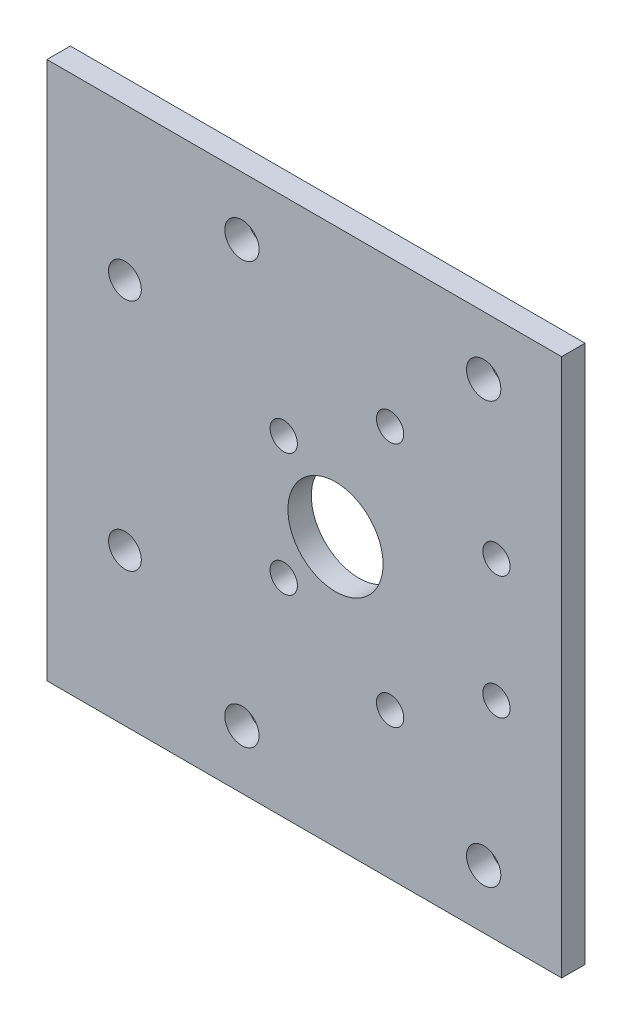
ISO-10303-21;
HEADER;
FILE_DESCRIPTION(('STEP AP214'),'2;1');
FILE_NAME('part.step','',(''),(''),'','','');
FILE_SCHEMA(('AUTOMOTIVE_DESIGN { 1 0 10303 214 1 1 1 1 }'));
ENDSEC;
DATA;
#1=APPLICATION_CONTEXT('core data for automotive mechanical design processes');
#2=APPLICATION_PROTOCOL_DEFINITION('international standard','automotive_design',2000,#1);
#3=PRODUCT_CONTEXT('',#1,'mechanical');
#4=PRODUCT('Part','Part','',(#3));
#5=PRODUCT_RELATED_PRODUCT_CATEGORY('part','',(#4));
#6=PRODUCT_DEFINITION_FORMATION('','',#4);
#7=PRODUCT_DEFINITION_CONTEXT('part definition',#1,'design');
#8=PRODUCT_DEFINITION('design','',#6,#7);
#9=PRODUCT_DEFINITION_SHAPE('','',#8);
#10=(LENGTH_UNIT() NAMED_UNIT(*) SI_UNIT(.MILLI.,.METRE.));
#11=(NAMED_UNIT(*) PLANE_ANGLE_UNIT() SI_UNIT($,.RADIAN.));
#12=(NAMED_UNIT(*) SI_UNIT($,.STERADIAN.) SOLID_ANGLE_UNIT());
#13=UNCERTAINTY_MEASURE_WITH_UNIT(LENGTH_MEASURE(1.E-05),#10,'distance_accuracy_value','');
#14=(GEOMETRIC_REPRESENTATION_CONTEXT(3) GLOBAL_UNCERTAINTY_ASSIGNED_CONTEXT((#13)) GLOBAL_UNIT_ASSIGNED_CONTEXT((#10,
#11,#12)) REPRESENTATION_CONTEXT('',''));
#15=CARTESIAN_POINT('',(0.,0.,0.));
#16=DIRECTION('',(0.,0.,1.));
#17=DIRECTION('',(1.,0.,0.));
#18=AXIS2_PLACEMENT_3D('',#15,#16,#17);
#19=CARTESIAN_POINT('',(0.,0.,3.));
#20=DIRECTION('',(0.,0.,1.));
#21=DIRECTION('',(1.,0.,0.));
#22=AXIS2_PLACEMENT_3D('',#19,#20,#21);
#23=PLANE('',#22);
#24=DIRECTION('',(0.,-1.,0.));
#25=VECTOR('',#24,1.);
#26=CARTESIAN_POINT('',(44.,-34.5,3.));
#27=LINE('',#26,#25);
#28=CARTESIAN_POINT('',(44.,34.5,3.));
#29=VERTEX_POINT('',#28);
#30=CARTESIAN_POINT('',(44.,-34.5,3.));
#31=VERTEX_POINT('',#30);
#32=EDGE_CURVE('E85',#29,#31,#27,.T.);
#33=ORIENTED_EDGE('',*,*,#32,.F.);
#34=DIRECTION('',(1.,0.,0.));
#35=VECTOR('',#34,1.);
#36=CARTESIAN_POINT('',(-22.,34.5,3.));
#37=LINE('',#36,#35);
#38=CARTESIAN_POINT('',(-22.,34.5,3.));
#39=VERTEX_POINT('',#38);
#40=EDGE_CURVE('E190',#39,#29,#37,.T.);
#41=ORIENTED_EDGE('',*,*,#40,.F.);
#42=DIRECTION('',(0.,1.,0.));
#43=VECTOR('',#42,1.);
#44=CARTESIAN_POINT('',(-22.,-24.5,3.));
#45=LINE('',#44,#43);
#46=CARTESIAN_POINT('',(-22.,-34.5,3.));
#47=VERTEX_POINT('',#46);
#48=EDGE_CURVE('E52',#47,#39,#45,.T.);
#49=ORIENTED_EDGE('',*,*,#48,.F.);
#50=DIRECTION('',(-1.,0.,0.));
#51=VECTOR('',#50,1.);
#52=CARTESIAN_POINT('',(-22.,-34.5,3.));
#53=LINE('',#52,#51);
#54=EDGE_CURVE('E68',#31,#47,#53,.T.);
#55=ORIENTED_EDGE('',*,*,#54,.F.);
#56=EDGE_LOOP('',(#33,#41,#49,#55));
#57=FACE_BOUND('',#56,.T.);
#58=CARTESIAN_POINT('',(-12.,-15.,3.));
#59=DIRECTION('',(0.,0.,1.));
#60=DIRECTION('',(1.,0.,0.));
#61=AXIS2_PLACEMENT_3D('',#58,#59,#60);
#62=CIRCLE('',#61,2.1);
#63=CARTESIAN_POINT('',(-9.9,-15.,3.));
#64=VERTEX_POINT('',#63);
#65=EDGE_CURVE('E144',#64,#64,#62,.T.);
#66=ORIENTED_EDGE('',*,*,#65,.F.);
#67=EDGE_LOOP('',(#66));
#68=FACE_BOUND('',#67,.T.);
#69=CARTESIAN_POINT('',(-12.,15.,3.));
#70=DIRECTION('',(0.,0.,1.));
#71=DIRECTION('',(1.,0.,0.));
#72=AXIS2_PLACEMENT_3D('',#69,#70,#71);
#73=CIRCLE('',#72,2.1);
#74=CARTESIAN_POINT('',(-9.9,15.,3.));
#75=VERTEX_POINT('',#74);
#76=EDGE_CURVE('E150',#75,#75,#73,.T.);
#77=ORIENTED_EDGE('',*,*,#76,.F.);
#78=EDGE_LOOP('',(#77));
#79=FACE_BOUND('',#78,.T.);
#80=CARTESIAN_POINT('',(35.6399001096049,-7.87499999999997,3.));
#81=DIRECTION('',(0.,0.,1.));
#82=DIRECTION('',(1.,0.,0.));
#83=AXIS2_PLACEMENT_3D('',#80,#81,#82);
#84=CIRCLE('',#83,1.75);
#85=CARTESIAN_POINT('',(37.3899001096049,-7.87499999999997,3.));
#86=VERTEX_POINT('',#85);
#87=EDGE_CURVE('E148',#86,#86,#84,.T.);
#88=ORIENTED_EDGE('',*,*,#87,.F.);
#89=EDGE_LOOP('',(#88));
#90=FACE_BOUND('',#89,.T.);
#91=CARTESIAN_POINT('',(35.6399001096049,7.87499999999996,3.));
#92=DIRECTION('',(0.,0.,1.));
#93=DIRECTION('',(1.,0.,0.));
#94=AXIS2_PLACEMENT_3D('',#91,#92,#93);
#95=CIRCLE('',#94,1.75);
#96=CARTESIAN_POINT('',(37.3899001096049,7.87499999999996,3.));
#97=VERTEX_POINT('',#96);
#98=EDGE_CURVE('E171',#97,#97,#95,.T.);
#99=ORIENTED_EDGE('',*,*,#98,.F.);
#100=EDGE_LOOP('',(#99));
#101=FACE_BOUND('',#100,.T.);
#102=CARTESIAN_POINT('',(22.,15.75,3.));
#103=DIRECTION('',(0.,0.,1.));
#104=DIRECTION('',(1.,0.,0.));
#105=AXIS2_PLACEMENT_3D('',#102,#103,#104);
#106=CIRCLE('',#105,1.75);
#107=CARTESIAN_POINT('',(23.75,15.75,3.));
#108=VERTEX_POINT('',#107);
#109=EDGE_CURVE('E168',#108,#108,#106,.T.);
#110=ORIENTED_EDGE('',*,*,#109,.F.);
#111=EDGE_LOOP('',(#110));
#112=FACE_BOUND('',#111,.T.);
#113=CARTESIAN_POINT('',(8.36009989039507,7.87499999999996,3.));
#114=DIRECTION('',(0.,0.,1.));
#115=DIRECTION('',(1.,0.,0.));
#116=AXIS2_PLACEMENT_3D('',#113,#114,#115);
#117=CIRCLE('',#116,1.75);
#118=CARTESIAN_POINT('',(10.1100998903951,7.87499999999996,3.));
#119=VERTEX_POINT('',#118);
#120=EDGE_CURVE('E165',#119,#119,#117,.T.);
#121=ORIENTED_EDGE('',*,*,#120,.F.);
#122=EDGE_LOOP('',(#121));
#123=FACE_BOUND('',#122,.T.);
#124=CARTESIAN_POINT('',(15.,0.,3.));
#125=DIRECTION('',(0.,0.,1.));
#126=DIRECTION('',(1.,0.,0.));
#127=AXIS2_PLACEMENT_3D('',#124,#125,#126);
#128=CIRCLE('',#127,6.1);
#129=CARTESIAN_POINT('',(21.1,0.,3.));
#130=VERTEX_POINT('',#129);
#131=EDGE_CURVE('E162',#130,#130,#128,.T.);
#132=ORIENTED_EDGE('',*,*,#131,.F.);
#133=EDGE_LOOP('',(#132));
#134=FACE_BOUND('',#133,.T.);
#135=CARTESIAN_POINT('',(22.,-15.75,3.));
#136=DIRECTION('',(0.,0.,1.));
#137=DIRECTION('',(1.,0.,0.));
#138=AXIS2_PLACEMENT_3D('',#135,#136,#137);
#139=CIRCLE('',#138,1.75);
#140=CARTESIAN_POINT('',(23.75,-15.75,3.));
#141=VERTEX_POINT('',#140);
#142=EDGE_CURVE('E159',#141,#141,#139,.T.);
#143=ORIENTED_EDGE('',*,*,#142,.F.);
#144=EDGE_LOOP('',(#143));
#145=FACE_BOUND('',#144,.T.);
#146=CARTESIAN_POINT('',(8.36009989039507,-7.87499999999997,3.));
#147=DIRECTION('',(0.,0.,1.));
#148=DIRECTION('',(1.,0.,0.));
#149=AXIS2_PLACEMENT_3D('',#146,#147,#148);
#150=CIRCLE('',#149,1.75);
#151=CARTESIAN_POINT('',(10.1100998903951,-7.87499999999997,3.));
#152=VERTEX_POINT('',#151);
#153=EDGE_CURVE('E124',#152,#152,#150,.T.);
#154=ORIENTED_EDGE('',*,*,#153,.F.);
#155=EDGE_LOOP('',(#154));
#156=FACE_BOUND('',#155,.T.);
#157=CARTESIAN_POINT('',(3.,27.,3.));
#158=DIRECTION('',(0.,0.,1.));
#159=DIRECTION('',(1.,0.,0.));
#160=AXIS2_PLACEMENT_3D('',#157,#158,#159);
#161=CIRCLE('',#160,2.2);
#162=CARTESIAN_POINT('',(5.2,27.,3.));
#163=VERTEX_POINT('',#162);
#164=EDGE_CURVE('E141',#163,#163,#161,.T.);
#165=ORIENTED_EDGE('',*,*,#164,.F.);
#166=EDGE_LOOP('',(#165));
#167=FACE_BOUND('',#166,.T.);
#168=CARTESIAN_POINT('',(34.,27.,3.));
#169=DIRECTION('',(0.,0.,1.));
#170=DIRECTION('',(1.,0.,0.));
#171=AXIS2_PLACEMENT_3D('',#168,#169,#170);
#172=CIRCLE('',#171,2.2);
#173=CARTESIAN_POINT('',(36.2,27.,3.));
#174=VERTEX_POINT('',#173);
#175=EDGE_CURVE('E181',#174,#174,#172,.T.);
#176=ORIENTED_EDGE('',*,*,#175,.F.);
#177=EDGE_LOOP('',(#176));
#178=FACE_BOUND('',#177,.T.);
#179=CARTESIAN_POINT('',(34.,-27.,3.));
#180=DIRECTION('',(0.,0.,1.));
#181=DIRECTION('',(1.,0.,0.));
#182=AXIS2_PLACEMENT_3D('',#179,#180,#181);
#183=CIRCLE('',#182,2.2);
#184=CARTESIAN_POINT('',(36.2,-27.,3.));
#185=VERTEX_POINT('',#184);
#186=EDGE_CURVE('E178',#185,#185,#183,.T.);
#187=ORIENTED_EDGE('',*,*,#186,.F.);
#188=EDGE_LOOP('',(#187));
#189=FACE_BOUND('',#188,.T.);
#190=CARTESIAN_POINT('',(3.,-27.,3.));
#191=DIRECTION('',(0.,0.,1.));
#192=DIRECTION('',(1.,0.,0.));
#193=AXIS2_PLACEMENT_3D('',#190,#191,#192);
#194=CIRCLE('',#193,2.2);
#195=CARTESIAN_POINT('',(5.2,-27.,3.));
#196=VERTEX_POINT('',#195);
#197=EDGE_CURVE('E110',#196,#196,#194,.T.);
#198=ORIENTED_EDGE('',*,*,#197,.F.);
#199=EDGE_LOOP('',(#198));
#200=FACE_BOUND('',#199,.T.);
#201=ADVANCED_FACE('F43',(#57,#68,#79,#90,#101,#112,#123,#134,#145,#156,#167,#178,#189,#200),
#23,.T.);
#202=CARTESIAN_POINT('',(0.,0.,0.));
#203=DIRECTION('',(0.,0.,1.));
#204=DIRECTION('',(1.,0.,0.));
#205=AXIS2_PLACEMENT_3D('',#202,#203,#204);
#206=PLANE('',#205);
#207=CARTESIAN_POINT('',(-12.,-15.,0.));
#208=DIRECTION('',(0.,0.,1.));
#209=DIRECTION('',(1.,0.,0.));
#210=AXIS2_PLACEMENT_3D('',#207,#208,#209);
#211=CIRCLE('',#210,2.1);
#212=CARTESIAN_POINT('',(-9.9,-15.,0.));
#213=VERTEX_POINT('',#212);
#214=EDGE_CURVE('E47',#213,#213,#211,.T.);
#215=ORIENTED_EDGE('',*,*,#214,.T.);
#216=EDGE_LOOP('',(#215));
#217=FACE_BOUND('',#216,.T.);
#218=CARTESIAN_POINT('',(-12.,15.,0.));
#219=DIRECTION('',(0.,0.,1.));
#220=DIRECTION('',(1.,0.,0.));
#221=AXIS2_PLACEMENT_3D('',#218,#219,#220);
#222=CIRCLE('',#221,2.1);
#223=CARTESIAN_POINT('',(-9.9,15.,0.));
#224=VERTEX_POINT('',#223);
#225=EDGE_CURVE('E142',#224,#224,#222,.T.);
#226=ORIENTED_EDGE('',*,*,#225,.T.);
#227=EDGE_LOOP('',(#226));
#228=FACE_BOUND('',#227,.T.);
#229=CARTESIAN_POINT('',(35.6399001096049,-7.87499999999997,0.));
#230=DIRECTION('',(0.,0.,1.));
#231=DIRECTION('',(1.,0.,0.));
#232=AXIS2_PLACEMENT_3D('',#229,#230,#231);
#233=CIRCLE('',#232,1.75);
#234=CARTESIAN_POINT('',(37.3899001096049,-7.87499999999997,0.));
#235=VERTEX_POINT('',#234);
#236=EDGE_CURVE('E139',#235,#235,#233,.T.);
#237=ORIENTED_EDGE('',*,*,#236,.T.);
#238=EDGE_LOOP('',(#237));
#239=FACE_BOUND('',#238,.T.);
#240=CARTESIAN_POINT('',(35.6399001096049,7.87499999999996,0.));
#241=DIRECTION('',(0.,0.,1.));
#242=DIRECTION('',(1.,0.,0.));
#243=AXIS2_PLACEMENT_3D('',#240,#241,#242);
#244=CIRCLE('',#243,1.75);
#245=CARTESIAN_POINT('',(37.3899001096049,7.87499999999996,0.));
#246=VERTEX_POINT('',#245);
#247=EDGE_CURVE('E136',#246,#246,#244,.T.);
#248=ORIENTED_EDGE('',*,*,#247,.T.);
#249=EDGE_LOOP('',(#248));
#250=FACE_BOUND('',#249,.T.);
#251=CARTESIAN_POINT('',(22.,15.75,0.));
#252=DIRECTION('',(0.,0.,1.));
#253=DIRECTION('',(1.,0.,0.));
#254=AXIS2_PLACEMENT_3D('',#251,#252,#253);
#255=CIRCLE('',#254,1.75);
#256=CARTESIAN_POINT('',(23.75,15.75,0.));
#257=VERTEX_POINT('',#256);
#258=EDGE_CURVE('E133',#257,#257,#255,.T.);
#259=ORIENTED_EDGE('',*,*,#258,.T.);
#260=EDGE_LOOP('',(#259));
#261=FACE_BOUND('',#260,.T.);
#262=CARTESIAN_POINT('',(8.36009989039507,7.87499999999996,0.));
#263=DIRECTION('',(0.,0.,1.));
#264=DIRECTION('',(1.,0.,0.));
#265=AXIS2_PLACEMENT_3D('',#262,#263,#264);
#266=CIRCLE('',#265,1.75);
#267=CARTESIAN_POINT('',(10.1100998903951,7.87499999999996,0.));
#268=VERTEX_POINT('',#267);
#269=EDGE_CURVE('E130',#268,#268,#266,.T.);
#270=ORIENTED_EDGE('',*,*,#269,.T.);
#271=EDGE_LOOP('',(#270));
#272=FACE_BOUND('',#271,.T.);
#273=CARTESIAN_POINT('',(15.,0.,0.));
#274=DIRECTION('',(0.,0.,1.));
#275=DIRECTION('',(1.,0.,0.));
#276=AXIS2_PLACEMENT_3D('',#273,#274,#275);
#277=CIRCLE('',#276,6.1);
#278=CARTESIAN_POINT('',(21.1,0.,0.));
#279=VERTEX_POINT('',#278);
#280=EDGE_CURVE('E127',#279,#279,#277,.T.);
#281=ORIENTED_EDGE('',*,*,#280,.T.);
#282=EDGE_LOOP('',(#281));
#283=FACE_BOUND('',#282,.T.);
#284=CARTESIAN_POINT('',(22.,-15.75,0.));
#285=DIRECTION('',(0.,0.,1.));
#286=DIRECTION('',(1.,0.,0.));
#287=AXIS2_PLACEMENT_3D('',#284,#285,#286);
#288=CIRCLE('',#287,1.75);
#289=CARTESIAN_POINT('',(23.75,-15.75,0.));
#290=VERTEX_POINT('',#289);
#291=EDGE_CURVE('E123',#290,#290,#288,.T.);
#292=ORIENTED_EDGE('',*,*,#291,.T.);
#293=EDGE_LOOP('',(#292));
#294=FACE_BOUND('',#293,.T.);
#295=CARTESIAN_POINT('',(8.36009989039507,-7.87499999999997,0.));
#296=DIRECTION('',(0.,0.,1.));
#297=DIRECTION('',(1.,0.,0.));
#298=AXIS2_PLACEMENT_3D('',#295,#296,#297);
#299=CIRCLE('',#298,1.75);
#300=CARTESIAN_POINT('',(10.1100998903951,-7.87499999999997,0.));
#301=VERTEX_POINT('',#300);
#302=EDGE_CURVE('E120',#301,#301,#299,.T.);
#303=ORIENTED_EDGE('',*,*,#302,.T.);
#304=EDGE_LOOP('',(#303));
#305=FACE_BOUND('',#304,.T.);
#306=CARTESIAN_POINT('',(3.,27.,0.));
#307=DIRECTION('',(0.,0.,1.));
#308=DIRECTION('',(1.,0.,0.));
#309=AXIS2_PLACEMENT_3D('',#306,#307,#308);
#310=CIRCLE('',#309,2.2);
#311=CARTESIAN_POINT('',(5.2,27.,0.));
#312=VERTEX_POINT('',#311);
#313=EDGE_CURVE('E116',#312,#312,#310,.T.);
#314=ORIENTED_EDGE('',*,*,#313,.T.);
#315=EDGE_LOOP('',(#314));
#316=FACE_BOUND('',#315,.T.);
#317=CARTESIAN_POINT('',(34.,27.,0.));
#318=DIRECTION('',(0.,0.,1.));
#319=DIRECTION('',(1.,0.,0.));
#320=AXIS2_PLACEMENT_3D('',#317,#318,#319);
#321=CIRCLE('',#320,2.2);
#322=CARTESIAN_POINT('',(36.2,27.,0.));
#323=VERTEX_POINT('',#322);
#324=EDGE_CURVE('E113',#323,#323,#321,.T.);
#325=ORIENTED_EDGE('',*,*,#324,.T.);
#326=EDGE_LOOP('',(#325));
#327=FACE_BOUND('',#326,.T.);
#328=CARTESIAN_POINT('',(34.,-27.,0.));
#329=DIRECTION('',(0.,0.,1.));
#330=DIRECTION('',(1.,0.,0.));
#331=AXIS2_PLACEMENT_3D('',#328,#329,#330);
#332=CIRCLE('',#331,2.2);
#333=CARTESIAN_POINT('',(36.2,-27.,0.));
#334=VERTEX_POINT('',#333);
#335=EDGE_CURVE('E109',#334,#334,#332,.T.);
#336=ORIENTED_EDGE('',*,*,#335,.T.);
#337=EDGE_LOOP('',(#336));
#338=FACE_BOUND('',#337,.T.);
#339=CARTESIAN_POINT('',(3.,-27.,0.));
#340=DIRECTION('',(0.,0.,1.));
#341=DIRECTION('',(1.,0.,0.));
#342=AXIS2_PLACEMENT_3D('',#339,#340,#341);
#343=CIRCLE('',#342,2.2);
#344=CARTESIAN_POINT('',(5.2,-27.,0.));
#345=VERTEX_POINT('',#344);
#346=EDGE_CURVE('E106',#345,#345,#343,.T.);
#347=ORIENTED_EDGE('',*,*,#346,.T.);
#348=EDGE_LOOP('',(#347));
#349=FACE_BOUND('',#348,.T.);
#350=DIRECTION('',(-1.,0.,0.));
#351=VECTOR('',#350,1.);
#352=CARTESIAN_POINT('',(-22.,34.5,0.));
#353=LINE('',#352,#351);
#354=CARTESIAN_POINT('',(44.,34.5,0.));
#355=VERTEX_POINT('',#354);
#356=CARTESIAN_POINT('',(-22.,34.5,0.));
#357=VERTEX_POINT('',#356);
#358=EDGE_CURVE('E192',#355,#357,#353,.T.);
#359=ORIENTED_EDGE('',*,*,#358,.F.);
#360=DIRECTION('',(0.,1.,0.));
#361=VECTOR('',#360,1.);
#362=CARTESIAN_POINT('',(44.,-34.5,0.));
#363=LINE('',#362,#361);
#364=CARTESIAN_POINT('',(44.,-34.5,0.));
#365=VERTEX_POINT('',#364);
#366=EDGE_CURVE('E60',#365,#355,#363,.T.);
#367=ORIENTED_EDGE('',*,*,#366,.F.);
#368=DIRECTION('',(1.,0.,0.));
#369=VECTOR('',#368,1.);
#370=CARTESIAN_POINT('',(-22.,-34.5,0.));
#371=LINE('',#370,#369);
#372=CARTESIAN_POINT('',(-22.,-34.5,0.));
#373=VERTEX_POINT('',#372);
#374=EDGE_CURVE('E96',#373,#365,#371,.T.);
#375=ORIENTED_EDGE('',*,*,#374,.F.);
#376=DIRECTION('',(0.,-1.,0.));
#377=VECTOR('',#376,1.);
#378=CARTESIAN_POINT('',(-22.,-24.5,0.));
#379=LINE('',#378,#377);
#380=EDGE_CURVE('E12',#357,#373,#379,.T.);
#381=ORIENTED_EDGE('',*,*,#380,.F.);
#382=EDGE_LOOP('',(#359,#367,#375,#381));
#383=FACE_BOUND('',#382,.T.);
#384=ADVANCED_FACE('F45',(#217,#228,#239,#250,#261,#272,#283,#294,#305,#316,#327,#338,#349,
#383),#206,.F.);
#385=CARTESIAN_POINT('',(-22.,0.,0.));
#386=DIRECTION('',(-1.,0.,0.));
#387=DIRECTION('',(0.,-1.,0.));
#388=AXIS2_PLACEMENT_3D('',#385,#386,#387);
#389=PLANE('',#388);
#390=ORIENTED_EDGE('',*,*,#48,.T.);
#391=DIRECTION('',(0.,0.,1.));
#392=VECTOR('',#391,1.);
#393=CARTESIAN_POINT('',(-22.,34.5,0.));
#394=LINE('',#393,#392);
#395=EDGE_CURVE('E119',#357,#39,#394,.T.);
#396=ORIENTED_EDGE('',*,*,#395,.F.);
#397=ORIENTED_EDGE('',*,*,#380,.T.);
#398=DIRECTION('',(0.,0.,-1.));
#399=VECTOR('',#398,1.);
#400=CARTESIAN_POINT('',(-22.,-34.5,0.));
#401=LINE('',#400,#399);
#402=EDGE_CURVE('E102',#47,#373,#401,.T.);
#403=ORIENTED_EDGE('',*,*,#402,.F.);
#404=EDGE_LOOP('',(#390,#396,#397,#403));
#405=FACE_BOUND('',#404,.T.);
#406=ADVANCED_FACE('F194',(#405),#389,.T.);
#407=CARTESIAN_POINT('',(0.,-34.5,0.));
#408=DIRECTION('',(0.,1.,0.));
#409=DIRECTION('',(0.,0.,1.));
#410=AXIS2_PLACEMENT_3D('',#407,#408,#409);
#411=PLANE('',#410);
#412=ORIENTED_EDGE('',*,*,#374,.T.);
#413=DIRECTION('',(0.,0.,-1.));
#414=VECTOR('',#413,1.);
#415=CARTESIAN_POINT('',(44.,-34.5,3.));
#416=LINE('',#415,#414);
#417=EDGE_CURVE('E87',#31,#365,#416,.T.);
#418=ORIENTED_EDGE('',*,*,#417,.F.);
#419=ORIENTED_EDGE('',*,*,#54,.T.);
#420=ORIENTED_EDGE('',*,*,#402,.T.);
#421=EDGE_LOOP('',(#412,#418,#419,#420));
#422=FACE_BOUND('',#421,.T.);
#423=ADVANCED_FACE('F94',(#422),#411,.F.);
#424=CARTESIAN_POINT('',(0.,34.5,0.));
#425=DIRECTION('',(0.,1.,0.));
#426=DIRECTION('',(0.,0.,1.));
#427=AXIS2_PLACEMENT_3D('',#424,#425,#426);
#428=PLANE('',#427);
#429=DIRECTION('',(0.,0.,1.));
#430=VECTOR('',#429,1.);
#431=CARTESIAN_POINT('',(44.,34.5,3.));
#432=LINE('',#431,#430);
#433=EDGE_CURVE('E88',#355,#29,#432,.T.);
#434=ORIENTED_EDGE('',*,*,#433,.F.);
#435=ORIENTED_EDGE('',*,*,#358,.T.);
#436=ORIENTED_EDGE('',*,*,#395,.T.);
#437=ORIENTED_EDGE('',*,*,#40,.T.);
#438=EDGE_LOOP('',(#434,#435,#436,#437));
#439=FACE_BOUND('',#438,.T.);
#440=ADVANCED_FACE('F200',(#439),#428,.T.);
#441=CARTESIAN_POINT('',(3.,-27.,-4.5));
#442=DIRECTION('',(0.,0.,1.));
#443=DIRECTION('',(1.,0.,0.));
#444=AXIS2_PLACEMENT_3D('',#441,#442,#443);
#445=CYLINDRICAL_SURFACE('',#444,2.2);
#446=ORIENTED_EDGE('',*,*,#197,.T.);
#447=EDGE_LOOP('',(#446));
#448=FACE_BOUND('',#447,.T.);
#449=ORIENTED_EDGE('',*,*,#346,.F.);
#450=EDGE_LOOP('',(#449));
#451=FACE_BOUND('',#450,.T.);
#452=ADVANCED_FACE('F202',(#448,#451),#445,.F.);
#453=CARTESIAN_POINT('',(34.,-27.,-4.5));
#454=DIRECTION('',(0.,0.,1.));
#455=DIRECTION('',(1.,0.,0.));
#456=AXIS2_PLACEMENT_3D('',#453,#454,#455);
#457=CYLINDRICAL_SURFACE('',#456,2.2);
#458=ORIENTED_EDGE('',*,*,#186,.T.);
#459=EDGE_LOOP('',(#458));
#460=FACE_BOUND('',#459,.T.);
#461=ORIENTED_EDGE('',*,*,#335,.F.);
#462=EDGE_LOOP('',(#461));
#463=FACE_BOUND('',#462,.T.);
#464=ADVANCED_FACE('F208',(#460,#463),#457,.F.);
#465=CARTESIAN_POINT('',(34.,27.,-4.5));
#466=DIRECTION('',(0.,0.,1.));
#467=DIRECTION('',(1.,0.,0.));
#468=AXIS2_PLACEMENT_3D('',#465,#466,#467);
#469=CYLINDRICAL_SURFACE('',#468,2.2);
#470=ORIENTED_EDGE('',*,*,#175,.T.);
#471=EDGE_LOOP('',(#470));
#472=FACE_BOUND('',#471,.T.);
#473=ORIENTED_EDGE('',*,*,#324,.F.);
#474=EDGE_LOOP('',(#473));
#475=FACE_BOUND('',#474,.T.);
#476=ADVANCED_FACE('F325',(#472,#475),#469,.F.);
#477=CARTESIAN_POINT('',(3.,27.,-4.5));
#478=DIRECTION('',(0.,0.,1.));
#479=DIRECTION('',(1.,0.,0.));
#480=AXIS2_PLACEMENT_3D('',#477,#478,#479);
#481=CYLINDRICAL_SURFACE('',#480,2.2);
#482=ORIENTED_EDGE('',*,*,#164,.T.);
#483=EDGE_LOOP('',(#482));
#484=FACE_BOUND('',#483,.T.);
#485=ORIENTED_EDGE('',*,*,#313,.F.);
#486=EDGE_LOOP('',(#485));
#487=FACE_BOUND('',#486,.T.);
#488=ADVANCED_FACE('F317',(#484,#487),#481,.F.);
#489=CARTESIAN_POINT('',(8.36009989039507,-7.87499999999997,-7.));
#490=DIRECTION('',(0.,0.,1.));
#491=DIRECTION('',(1.,0.,0.));
#492=AXIS2_PLACEMENT_3D('',#489,#490,#491);
#493=CYLINDRICAL_SURFACE('',#492,1.75);
#494=ORIENTED_EDGE('',*,*,#153,.T.);
#495=EDGE_LOOP('',(#494));
#496=FACE_BOUND('',#495,.T.);
#497=ORIENTED_EDGE('',*,*,#302,.F.);
#498=EDGE_LOOP('',(#497));
#499=FACE_BOUND('',#498,.T.);
#500=ADVANCED_FACE('F309',(#496,#499),#493,.F.);
#501=CARTESIAN_POINT('',(22.,-15.75,-7.));
#502=DIRECTION('',(0.,0.,1.));
#503=DIRECTION('',(1.,0.,0.));
#504=AXIS2_PLACEMENT_3D('',#501,#502,#503);
#505=CYLINDRICAL_SURFACE('',#504,1.75);
#506=ORIENTED_EDGE('',*,*,#142,.T.);
#507=EDGE_LOOP('',(#506));
#508=FACE_BOUND('',#507,.T.);
#509=ORIENTED_EDGE('',*,*,#291,.F.);
#510=EDGE_LOOP('',(#509));
#511=FACE_BOUND('',#510,.T.);
#512=ADVANCED_FACE('F301',(#508,#511),#505,.F.);
#513=CARTESIAN_POINT('',(15.,0.,-7.));
#514=DIRECTION('',(0.,0.,1.));
#515=DIRECTION('',(1.,0.,0.));
#516=AXIS2_PLACEMENT_3D('',#513,#514,#515);
#517=CYLINDRICAL_SURFACE('',#516,6.1);
#518=ORIENTED_EDGE('',*,*,#131,.T.);
#519=EDGE_LOOP('',(#518));
#520=FACE_BOUND('',#519,.T.);
#521=ORIENTED_EDGE('',*,*,#280,.F.);
#522=EDGE_LOOP('',(#521));
#523=FACE_BOUND('',#522,.T.);
#524=ADVANCED_FACE('F293',(#520,#523),#517,.F.);
#525=CARTESIAN_POINT('',(8.36009989039507,7.87499999999996,-7.));
#526=DIRECTION('',(0.,0.,1.));
#527=DIRECTION('',(1.,0.,0.));
#528=AXIS2_PLACEMENT_3D('',#525,#526,#527);
#529=CYLINDRICAL_SURFACE('',#528,1.75);
#530=ORIENTED_EDGE('',*,*,#120,.T.);
#531=EDGE_LOOP('',(#530));
#532=FACE_BOUND('',#531,.T.);
#533=ORIENTED_EDGE('',*,*,#269,.F.);
#534=EDGE_LOOP('',(#533));
#535=FACE_BOUND('',#534,.T.);
#536=ADVANCED_FACE('F285',(#532,#535),#529,.F.);
#537=CARTESIAN_POINT('',(22.,15.75,-7.));
#538=DIRECTION('',(0.,0.,1.));
#539=DIRECTION('',(1.,0.,0.));
#540=AXIS2_PLACEMENT_3D('',#537,#538,#539);
#541=CYLINDRICAL_SURFACE('',#540,1.75);
#542=ORIENTED_EDGE('',*,*,#109,.T.);
#543=EDGE_LOOP('',(#542));
#544=FACE_BOUND('',#543,.T.);
#545=ORIENTED_EDGE('',*,*,#258,.F.);
#546=EDGE_LOOP('',(#545));
#547=FACE_BOUND('',#546,.T.);
#548=ADVANCED_FACE('F277',(#544,#547),#541,.F.);
#549=CARTESIAN_POINT('',(35.6399001096049,7.87499999999996,-7.));
#550=DIRECTION('',(0.,0.,1.));
#551=DIRECTION('',(1.,0.,0.));
#552=AXIS2_PLACEMENT_3D('',#549,#550,#551);
#553=CYLINDRICAL_SURFACE('',#552,1.75);
#554=ORIENTED_EDGE('',*,*,#98,.T.);
#555=EDGE_LOOP('',(#554));
#556=FACE_BOUND('',#555,.T.);
#557=ORIENTED_EDGE('',*,*,#247,.F.);
#558=EDGE_LOOP('',(#557));
#559=FACE_BOUND('',#558,.T.);
#560=ADVANCED_FACE('F269',(#556,#559),#553,.F.);
#561=CARTESIAN_POINT('',(35.6399001096049,-7.87499999999997,-7.));
#562=DIRECTION('',(0.,0.,1.));
#563=DIRECTION('',(1.,0.,0.));
#564=AXIS2_PLACEMENT_3D('',#561,#562,#563);
#565=CYLINDRICAL_SURFACE('',#564,1.75);
#566=ORIENTED_EDGE('',*,*,#87,.T.);
#567=EDGE_LOOP('',(#566));
#568=FACE_BOUND('',#567,.T.);
#569=ORIENTED_EDGE('',*,*,#236,.F.);
#570=EDGE_LOOP('',(#569));
#571=FACE_BOUND('',#570,.T.);
#572=ADVANCED_FACE('F261',(#568,#571),#565,.F.);
#573=CARTESIAN_POINT('',(-12.,15.,-7.));
#574=DIRECTION('',(0.,0.,1.));
#575=DIRECTION('',(1.,0.,0.));
#576=AXIS2_PLACEMENT_3D('',#573,#574,#575);
#577=CYLINDRICAL_SURFACE('',#576,2.1);
#578=ORIENTED_EDGE('',*,*,#76,.T.);
#579=EDGE_LOOP('',(#578));
#580=FACE_BOUND('',#579,.T.);
#581=ORIENTED_EDGE('',*,*,#225,.F.);
#582=EDGE_LOOP('',(#581));
#583=FACE_BOUND('',#582,.T.);
#584=ADVANCED_FACE('F255',(#580,#583),#577,.F.);
#585=CARTESIAN_POINT('',(-12.,-15.,-7.));
#586=DIRECTION('',(0.,0.,1.));
#587=DIRECTION('',(1.,0.,0.));
#588=AXIS2_PLACEMENT_3D('',#585,#586,#587);
#589=CYLINDRICAL_SURFACE('',#588,2.1);
#590=ORIENTED_EDGE('',*,*,#65,.T.);
#591=EDGE_LOOP('',(#590));
#592=FACE_BOUND('',#591,.T.);
#593=ORIENTED_EDGE('',*,*,#214,.F.);
#594=EDGE_LOOP('',(#593));
#595=FACE_BOUND('',#594,.T.);
#596=ADVANCED_FACE('F245',(#592,#595),#589,.F.);
#597=CARTESIAN_POINT('',(44.,0.,0.));
#598=DIRECTION('',(-1.,0.,0.));
#599=DIRECTION('',(0.,0.,1.));
#600=AXIS2_PLACEMENT_3D('',#597,#598,#599);
#601=PLANE('',#600);
#602=ORIENTED_EDGE('',*,*,#32,.T.);
#603=ORIENTED_EDGE('',*,*,#417,.T.);
#604=ORIENTED_EDGE('',*,*,#366,.T.);
#605=ORIENTED_EDGE('',*,*,#433,.T.);
#606=EDGE_LOOP('',(#602,#603,#604,#605));
#607=FACE_BOUND('',#606,.T.);
#608=ADVANCED_FACE('F86',(#607),#601,.F.);
#609=CLOSED_SHELL('',(#201,#384,#406,#423,#440,#452,#464,#476,#488,#500,#512,#524,#536,#548,
#560,#572,#584,#596,#608));
#610=MANIFOLD_SOLID_BREP('B2',#609);
#611=ADVANCED_BREP_SHAPE_REPRESENTATION('',(#18,#610),#14);
#612=SHAPE_DEFINITION_REPRESENTATION(#9,#611);
ENDSEC;
END-ISO-10303-21;
